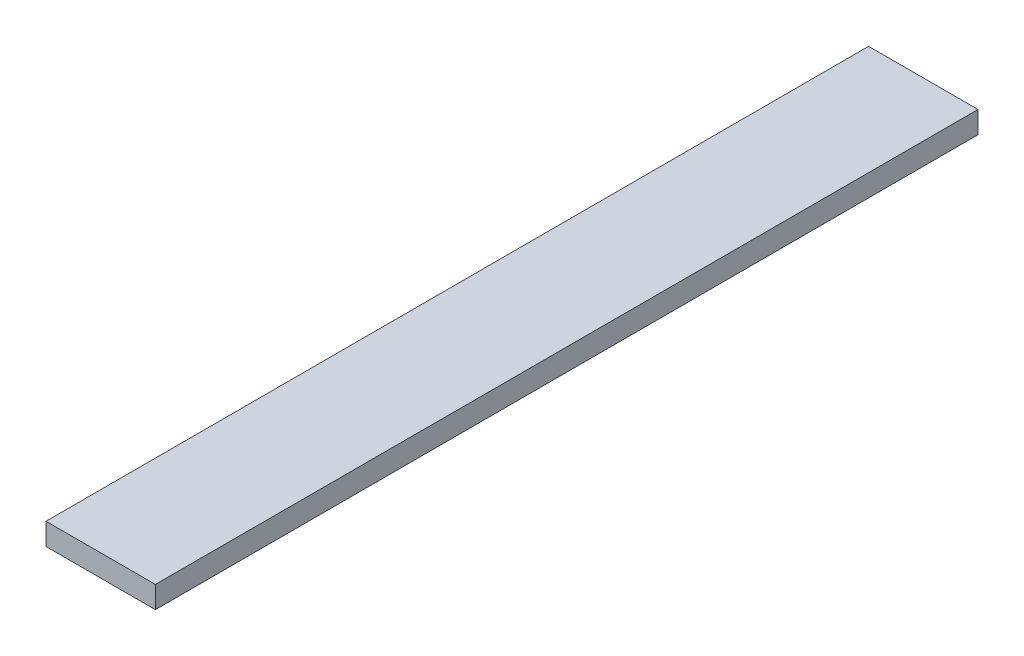
ISO-10303-21;
HEADER;
FILE_DESCRIPTION(('STEP AP214'),'2;1');
FILE_NAME('part.step','',(''),(''),'','','');
FILE_SCHEMA(('AUTOMOTIVE_DESIGN { 1 0 10303 214 1 1 1 1 }'));
ENDSEC;
DATA;
#1=APPLICATION_CONTEXT('core data for automotive mechanical design processes');
#2=APPLICATION_PROTOCOL_DEFINITION('international standard','automotive_design',2000,#1);
#3=PRODUCT_CONTEXT('',#1,'mechanical');
#4=PRODUCT('Part','Part','',(#3));
#5=PRODUCT_RELATED_PRODUCT_CATEGORY('part','',(#4));
#6=PRODUCT_DEFINITION_FORMATION('','',#4);
#7=PRODUCT_DEFINITION_CONTEXT('part definition',#1,'design');
#8=PRODUCT_DEFINITION('design','',#6,#7);
#9=PRODUCT_DEFINITION_SHAPE('','',#8);
#10=(LENGTH_UNIT() NAMED_UNIT(*) SI_UNIT(.MILLI.,.METRE.));
#11=(NAMED_UNIT(*) PLANE_ANGLE_UNIT() SI_UNIT($,.RADIAN.));
#12=(NAMED_UNIT(*) SI_UNIT($,.STERADIAN.) SOLID_ANGLE_UNIT());
#13=UNCERTAINTY_MEASURE_WITH_UNIT(LENGTH_MEASURE(1.E-05),#10,'distance_accuracy_value','');
#14=(GEOMETRIC_REPRESENTATION_CONTEXT(3) GLOBAL_UNCERTAINTY_ASSIGNED_CONTEXT((#13)) GLOBAL_UNIT_ASSIGNED_CONTEXT((#10,
#11,#12)) REPRESENTATION_CONTEXT('',''));
#15=CARTESIAN_POINT('',(0.,0.,0.));
#16=DIRECTION('',(0.,0.,1.));
#17=DIRECTION('',(1.,0.,0.));
#18=AXIS2_PLACEMENT_3D('',#15,#16,#17);
#19=CARTESIAN_POINT('',(0.,2.02999999999,0.));
#20=DIRECTION('',(0.,1.,0.));
#21=DIRECTION('',(0.,0.,1.));
#22=AXIS2_PLACEMENT_3D('',#19,#20,#21);
#23=PLANE('',#22);
#24=DIRECTION('',(0.,0.,1.));
#25=VECTOR('',#24,1.);
#26=CARTESIAN_POINT('',(1.875,2.02999999999,0.195));
#27=LINE('',#26,#25);
#28=CARTESIAN_POINT('',(1.875,2.02999999999,0.195));
#29=VERTEX_POINT('',#28);
#30=CARTESIAN_POINT('',(1.875,2.02999999999,2.075));
#31=VERTEX_POINT('',#30);
#32=EDGE_CURVE('E80',#29,#31,#27,.T.);
#33=ORIENTED_EDGE('',*,*,#32,.T.);
#34=DIRECTION('',(-1.,0.,0.));
#35=VECTOR('',#34,1.);
#36=CARTESIAN_POINT('',(1.875,2.02999999999,2.075));
#37=LINE('',#36,#35);
#38=CARTESIAN_POINT('',(1.625,2.02999999999,2.075));
#39=VERTEX_POINT('',#38);
#40=EDGE_CURVE('E67',#31,#39,#37,.T.);
#41=ORIENTED_EDGE('',*,*,#40,.T.);
#42=DIRECTION('',(0.,0.,1.));
#43=VECTOR('',#42,1.);
#44=CARTESIAN_POINT('',(1.625,2.02999999999,0.195));
#45=LINE('',#44,#43);
#46=CARTESIAN_POINT('',(1.625,2.02999999999,0.195));
#47=VERTEX_POINT('',#46);
#48=EDGE_CURVE('E54',#39,#47,#45,.F.);
#49=ORIENTED_EDGE('',*,*,#48,.T.);
#50=DIRECTION('',(1.,0.,0.));
#51=VECTOR('',#50,1.);
#52=CARTESIAN_POINT('',(1.875,2.02999999999,0.195));
#53=LINE('',#52,#51);
#54=EDGE_CURVE('E19',#47,#29,#53,.T.);
#55=ORIENTED_EDGE('',*,*,#54,.T.);
#56=EDGE_LOOP('',(#33,#41,#49,#55));
#57=FACE_BOUND('',#56,.T.);
#58=ADVANCED_FACE('F16',(#57),#23,.F.);
#59=CARTESIAN_POINT('',(1.875,2.07999999999,0.195));
#60=DIRECTION('',(0.,0.,1.));
#61=DIRECTION('',(1.,0.,0.));
#62=AXIS2_PLACEMENT_3D('',#59,#60,#61);
#63=PLANE('',#62);
#64=DIRECTION('',(0.,1.,0.));
#65=VECTOR('',#64,1.);
#66=CARTESIAN_POINT('',(1.625,2.07999999999,0.195));
#67=LINE('',#66,#65);
#68=CARTESIAN_POINT('',(1.625,2.07999999999,0.195));
#69=VERTEX_POINT('',#68);
#70=EDGE_CURVE('E60',#47,#69,#67,.T.);
#71=ORIENTED_EDGE('',*,*,#70,.T.);
#72=DIRECTION('',(1.,0.,0.));
#73=VECTOR('',#72,1.);
#74=CARTESIAN_POINT('',(0.,2.07999999999,0.195));
#75=LINE('',#74,#73);
#76=CARTESIAN_POINT('',(1.875,2.07999999999,0.195));
#77=VERTEX_POINT('',#76);
#78=EDGE_CURVE('E82',#77,#69,#75,.F.);
#79=ORIENTED_EDGE('',*,*,#78,.F.);
#80=DIRECTION('',(0.,-1.,0.));
#81=VECTOR('',#80,1.);
#82=CARTESIAN_POINT('',(1.875,2.07999999999,0.195));
#83=LINE('',#82,#81);
#84=EDGE_CURVE('E63',#77,#29,#83,.T.);
#85=ORIENTED_EDGE('',*,*,#84,.T.);
#86=ORIENTED_EDGE('',*,*,#54,.F.);
#87=EDGE_LOOP('',(#71,#79,#85,#86));
#88=FACE_BOUND('',#87,.T.);
#89=ADVANCED_FACE('F59',(#88),#63,.F.);
#90=CARTESIAN_POINT('',(1.625,2.07999999999,0.195));
#91=DIRECTION('',(1.,0.,0.));
#92=DIRECTION('',(0.,1.,0.));
#93=AXIS2_PLACEMENT_3D('',#90,#91,#92);
#94=PLANE('',#93);
#95=DIRECTION('',(0.,1.,0.));
#96=VECTOR('',#95,1.);
#97=CARTESIAN_POINT('',(1.625,2.07999999999,2.075));
#98=LINE('',#97,#96);
#99=CARTESIAN_POINT('',(1.625,2.07999999999,2.075));
#100=VERTEX_POINT('',#99);
#101=EDGE_CURVE('E69',#39,#100,#98,.T.);
#102=ORIENTED_EDGE('',*,*,#101,.T.);
#103=DIRECTION('',(0.,0.,1.));
#104=VECTOR('',#103,1.);
#105=CARTESIAN_POINT('',(1.625,2.07999999999,0.));
#106=LINE('',#105,#104);
#107=EDGE_CURVE('E73',#69,#100,#106,.T.);
#108=ORIENTED_EDGE('',*,*,#107,.F.);
#109=ORIENTED_EDGE('',*,*,#70,.F.);
#110=ORIENTED_EDGE('',*,*,#48,.F.);
#111=EDGE_LOOP('',(#102,#108,#109,#110));
#112=FACE_BOUND('',#111,.T.);
#113=ADVANCED_FACE('F71',(#112),#94,.F.);
#114=CARTESIAN_POINT('',(1.875,2.07999999999,2.075));
#115=DIRECTION('',(0.,0.,-1.));
#116=DIRECTION('',(-1.,0.,0.));
#117=AXIS2_PLACEMENT_3D('',#114,#115,#116);
#118=PLANE('',#117);
#119=DIRECTION('',(0.,-1.,0.));
#120=VECTOR('',#119,1.);
#121=CARTESIAN_POINT('',(1.875,2.07999999999,2.075));
#122=LINE('',#121,#120);
#123=CARTESIAN_POINT('',(1.875,2.07999999999,2.075));
#124=VERTEX_POINT('',#123);
#125=EDGE_CURVE('E34',#31,#124,#122,.F.);
#126=ORIENTED_EDGE('',*,*,#125,.T.);
#127=DIRECTION('',(1.,0.,0.));
#128=VECTOR('',#127,1.);
#129=CARTESIAN_POINT('',(0.,2.07999999999,2.075));
#130=LINE('',#129,#128);
#131=EDGE_CURVE('E25',#100,#124,#130,.T.);
#132=ORIENTED_EDGE('',*,*,#131,.F.);
#133=ORIENTED_EDGE('',*,*,#101,.F.);
#134=ORIENTED_EDGE('',*,*,#40,.F.);
#135=EDGE_LOOP('',(#126,#132,#133,#134));
#136=FACE_BOUND('',#135,.T.);
#137=ADVANCED_FACE('F88',(#136),#118,.F.);
#138=CARTESIAN_POINT('',(1.875,2.07999999999,0.195));
#139=DIRECTION('',(-1.,0.,0.));
#140=DIRECTION('',(0.,-1.,0.));
#141=AXIS2_PLACEMENT_3D('',#138,#139,#140);
#142=PLANE('',#141);
#143=ORIENTED_EDGE('',*,*,#84,.F.);
#144=DIRECTION('',(0.,0.,1.));
#145=VECTOR('',#144,1.);
#146=CARTESIAN_POINT('',(1.875,2.07999999999,0.));
#147=LINE('',#146,#145);
#148=EDGE_CURVE('E11',#124,#77,#147,.F.);
#149=ORIENTED_EDGE('',*,*,#148,.F.);
#150=ORIENTED_EDGE('',*,*,#125,.F.);
#151=ORIENTED_EDGE('',*,*,#32,.F.);
#152=EDGE_LOOP('',(#143,#149,#150,#151));
#153=FACE_BOUND('',#152,.T.);
#154=ADVANCED_FACE('F90',(#153),#142,.F.);
#155=CARTESIAN_POINT('',(0.,2.07999999999,0.));
#156=DIRECTION('',(0.,1.,0.));
#157=DIRECTION('',(0.,0.,1.));
#158=AXIS2_PLACEMENT_3D('',#155,#156,#157);
#159=PLANE('',#158);
#160=ORIENTED_EDGE('',*,*,#131,.T.);
#161=ORIENTED_EDGE('',*,*,#148,.T.);
#162=ORIENTED_EDGE('',*,*,#78,.T.);
#163=ORIENTED_EDGE('',*,*,#107,.T.);
#164=EDGE_LOOP('',(#160,#161,#162,#163));
#165=FACE_BOUND('',#164,.T.);
#166=ADVANCED_FACE('F87',(#165),#159,.T.);
#167=CLOSED_SHELL('',(#58,#89,#113,#137,#154,#166));
#168=MANIFOLD_SOLID_BREP('B1',#167);
#169=ADVANCED_BREP_SHAPE_REPRESENTATION('',(#18,#168),#14);
#170=SHAPE_DEFINITION_REPRESENTATION(#9,#169);
ENDSEC;
END-ISO-10303-21;
